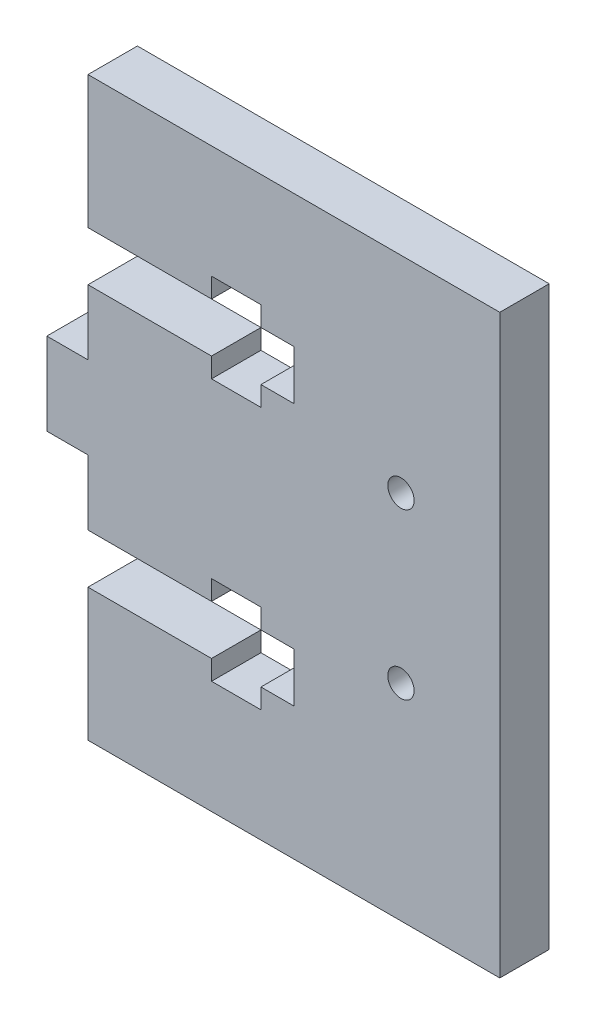
ISO-10303-21;
HEADER;
FILE_DESCRIPTION(('STEP AP214'),'2;1');
FILE_NAME('part.step','',(''),(''),'','','');
FILE_SCHEMA(('AUTOMOTIVE_DESIGN { 1 0 10303 214 1 1 1 1 }'));
ENDSEC;
DATA;
#1=APPLICATION_CONTEXT('core data for automotive mechanical design processes');
#2=APPLICATION_PROTOCOL_DEFINITION('international standard','automotive_design',2000,#1);
#3=PRODUCT_CONTEXT('',#1,'mechanical');
#4=PRODUCT('Part','Part','',(#3));
#5=PRODUCT_RELATED_PRODUCT_CATEGORY('part','',(#4));
#6=PRODUCT_DEFINITION_FORMATION('','',#4);
#7=PRODUCT_DEFINITION_CONTEXT('part definition',#1,'design');
#8=PRODUCT_DEFINITION('design','',#6,#7);
#9=PRODUCT_DEFINITION_SHAPE('','',#8);
#10=(LENGTH_UNIT() NAMED_UNIT(*) SI_UNIT(.MILLI.,.METRE.));
#11=(NAMED_UNIT(*) PLANE_ANGLE_UNIT() SI_UNIT($,.RADIAN.));
#12=(NAMED_UNIT(*) SI_UNIT($,.STERADIAN.) SOLID_ANGLE_UNIT());
#13=UNCERTAINTY_MEASURE_WITH_UNIT(LENGTH_MEASURE(1.E-05),#10,'distance_accuracy_value','');
#14=(GEOMETRIC_REPRESENTATION_CONTEXT(3) GLOBAL_UNCERTAINTY_ASSIGNED_CONTEXT((#13)) GLOBAL_UNIT_ASSIGNED_CONTEXT((#10,
#11,#12)) REPRESENTATION_CONTEXT('',''));
#15=CARTESIAN_POINT('',(0.,0.,0.));
#16=DIRECTION('',(0.,0.,1.));
#17=DIRECTION('',(1.,0.,0.));
#18=AXIS2_PLACEMENT_3D('',#15,#16,#17);
#19=CARTESIAN_POINT('',(0.,0.,6.));
#20=DIRECTION('',(0.,0.,1.));
#21=DIRECTION('',(1.,0.,0.));
#22=AXIS2_PLACEMENT_3D('',#19,#20,#21);
#23=PLANE('',#22);
#24=CARTESIAN_POINT('',(-82.9999999999995,-10.,6.));
#25=DIRECTION('',(0.,0.,1.));
#26=DIRECTION('',(1.,0.,0.));
#27=AXIS2_PLACEMENT_3D('',#24,#25,#26);
#28=CIRCLE('',#27,1.59999999999996);
#29=CARTESIAN_POINT('',(-81.3999999999996,-10.,6.));
#30=VERTEX_POINT('',#29);
#31=EDGE_CURVE('E278',#30,#30,#28,.T.);
#32=ORIENTED_EDGE('',*,*,#31,.F.);
#33=EDGE_LOOP('',(#32));
#34=FACE_BOUND('',#33,.T.);
#35=DIRECTION('',(0.,-1.,0.));
#36=VECTOR('',#35,1.);
#37=CARTESIAN_POINT('',(-121.,18.9,6.));
#38=LINE('',#37,#36);
#39=CARTESIAN_POINT('',(-121.,35.,6.));
#40=VERTEX_POINT('',#39);
#41=CARTESIAN_POINT('',(-121.,18.9,6.));
#42=VERTEX_POINT('',#41);
#43=EDGE_CURVE('E337',#40,#42,#38,.T.);
#44=ORIENTED_EDGE('',*,*,#43,.T.);
#45=DIRECTION('',(1.,0.,0.));
#46=VECTOR('',#45,1.);
#47=CARTESIAN_POINT('',(-106.,18.9,6.));
#48=LINE('',#47,#46);
#49=CARTESIAN_POINT('',(-106.,18.9,6.));
#50=VERTEX_POINT('',#49);
#51=EDGE_CURVE('E165',#42,#50,#48,.T.);
#52=ORIENTED_EDGE('',*,*,#51,.T.);
#53=DIRECTION('',(0.,1.,0.));
#54=VECTOR('',#53,1.);
#55=CARTESIAN_POINT('',(-106.,21.3,6.));
#56=LINE('',#55,#54);
#57=CARTESIAN_POINT('',(-106.,21.3,6.));
#58=VERTEX_POINT('',#57);
#59=EDGE_CURVE('E424',#50,#58,#56,.T.);
#60=ORIENTED_EDGE('',*,*,#59,.T.);
#61=DIRECTION('',(1.,0.,0.));
#62=VECTOR('',#61,1.);
#63=CARTESIAN_POINT('',(-100.,21.3,6.));
#64=LINE('',#63,#62);
#65=CARTESIAN_POINT('',(-100.,21.3,6.));
#66=VERTEX_POINT('',#65);
#67=EDGE_CURVE('E443',#58,#66,#64,.T.);
#68=ORIENTED_EDGE('',*,*,#67,.T.);
#69=DIRECTION('',(0.,-1.,0.));
#70=VECTOR('',#69,1.);
#71=CARTESIAN_POINT('',(-100.,18.9,6.));
#72=LINE('',#71,#70);
#73=CARTESIAN_POINT('',(-100.,18.9,6.));
#74=VERTEX_POINT('',#73);
#75=EDGE_CURVE('E440',#66,#74,#72,.T.);
#76=ORIENTED_EDGE('',*,*,#75,.T.);
#77=DIRECTION('',(1.,0.,0.));
#78=VECTOR('',#77,1.);
#79=CARTESIAN_POINT('',(-96.0000000000001,18.9,6.));
#80=LINE('',#79,#78);
#81=CARTESIAN_POINT('',(-96.0000000000001,18.9,6.));
#82=VERTEX_POINT('',#81);
#83=EDGE_CURVE('E442',#74,#82,#80,.T.);
#84=ORIENTED_EDGE('',*,*,#83,.T.);
#85=DIRECTION('',(0.,-1.,0.));
#86=VECTOR('',#85,1.);
#87=CARTESIAN_POINT('',(-96.0000000000001,12.9,6.));
#88=LINE('',#87,#86);
#89=CARTESIAN_POINT('',(-96.0000000000001,12.9,6.));
#90=VERTEX_POINT('',#89);
#91=EDGE_CURVE('E445',#82,#90,#88,.T.);
#92=ORIENTED_EDGE('',*,*,#91,.T.);
#93=DIRECTION('',(-1.,0.,0.));
#94=VECTOR('',#93,1.);
#95=CARTESIAN_POINT('',(-100.,12.9,6.));
#96=LINE('',#95,#94);
#97=CARTESIAN_POINT('',(-100.,12.9,6.));
#98=VERTEX_POINT('',#97);
#99=EDGE_CURVE('E451',#90,#98,#96,.T.);
#100=ORIENTED_EDGE('',*,*,#99,.T.);
#101=DIRECTION('',(0.,-1.,0.));
#102=VECTOR('',#101,1.);
#103=CARTESIAN_POINT('',(-100.,10.5,6.));
#104=LINE('',#103,#102);
#105=CARTESIAN_POINT('',(-100.,10.5,6.));
#106=VERTEX_POINT('',#105);
#107=EDGE_CURVE('E453',#98,#106,#104,.T.);
#108=ORIENTED_EDGE('',*,*,#107,.T.);
#109=DIRECTION('',(-1.,0.,0.));
#110=VECTOR('',#109,1.);
#111=CARTESIAN_POINT('',(-106.,10.5,6.));
#112=LINE('',#111,#110);
#113=CARTESIAN_POINT('',(-106.,10.5,6.));
#114=VERTEX_POINT('',#113);
#115=EDGE_CURVE('E455',#106,#114,#112,.T.);
#116=ORIENTED_EDGE('',*,*,#115,.T.);
#117=DIRECTION('',(0.,1.,0.));
#118=VECTOR('',#117,1.);
#119=CARTESIAN_POINT('',(-106.,12.9,6.));
#120=LINE('',#119,#118);
#121=CARTESIAN_POINT('',(-106.,12.9,6.));
#122=VERTEX_POINT('',#121);
#123=EDGE_CURVE('E457',#114,#122,#120,.T.);
#124=ORIENTED_EDGE('',*,*,#123,.T.);
#125=DIRECTION('',(-1.,0.,0.));
#126=VECTOR('',#125,1.);
#127=CARTESIAN_POINT('',(-121.,12.9,6.));
#128=LINE('',#127,#126);
#129=CARTESIAN_POINT('',(-121.,12.9,6.));
#130=VERTEX_POINT('',#129);
#131=EDGE_CURVE('E459',#122,#130,#128,.T.);
#132=ORIENTED_EDGE('',*,*,#131,.T.);
#133=DIRECTION('',(0.,-1.,0.));
#134=VECTOR('',#133,1.);
#135=CARTESIAN_POINT('',(-121.,5.,6.));
#136=LINE('',#135,#134);
#137=CARTESIAN_POINT('',(-121.,5.,6.));
#138=VERTEX_POINT('',#137);
#139=EDGE_CURVE('E461',#130,#138,#136,.T.);
#140=ORIENTED_EDGE('',*,*,#139,.T.);
#141=DIRECTION('',(-1.,0.,0.));
#142=VECTOR('',#141,1.);
#143=CARTESIAN_POINT('',(-121.,5.,6.));
#144=LINE('',#143,#142);
#145=CARTESIAN_POINT('',(-126.,5.,6.));
#146=VERTEX_POINT('',#145);
#147=EDGE_CURVE('E463',#138,#146,#144,.T.);
#148=ORIENTED_EDGE('',*,*,#147,.T.);
#149=DIRECTION('',(0.,-1.,0.));
#150=VECTOR('',#149,1.);
#151=CARTESIAN_POINT('',(-126.,5.,6.));
#152=LINE('',#151,#150);
#153=CARTESIAN_POINT('',(-126.,-5.,6.));
#154=VERTEX_POINT('',#153);
#155=EDGE_CURVE('E465',#146,#154,#152,.T.);
#156=ORIENTED_EDGE('',*,*,#155,.T.);
#157=DIRECTION('',(1.,0.,0.));
#158=VECTOR('',#157,1.);
#159=CARTESIAN_POINT('',(-121.,-5.,6.));
#160=LINE('',#159,#158);
#161=CARTESIAN_POINT('',(-121.,-5.,6.));
#162=VERTEX_POINT('',#161);
#163=EDGE_CURVE('E467',#154,#162,#160,.T.);
#164=ORIENTED_EDGE('',*,*,#163,.T.);
#165=DIRECTION('',(0.,-1.,0.));
#166=VECTOR('',#165,1.);
#167=CARTESIAN_POINT('',(-121.,-12.9,6.));
#168=LINE('',#167,#166);
#169=CARTESIAN_POINT('',(-121.,-12.9,6.));
#170=VERTEX_POINT('',#169);
#171=EDGE_CURVE('E469',#162,#170,#168,.T.);
#172=ORIENTED_EDGE('',*,*,#171,.T.);
#173=DIRECTION('',(1.,0.,0.));
#174=VECTOR('',#173,1.);
#175=CARTESIAN_POINT('',(-106.,-12.9,6.));
#176=LINE('',#175,#174);
#177=CARTESIAN_POINT('',(-106.,-12.9,6.));
#178=VERTEX_POINT('',#177);
#179=EDGE_CURVE('E471',#170,#178,#176,.T.);
#180=ORIENTED_EDGE('',*,*,#179,.T.);
#181=DIRECTION('',(0.,1.,0.));
#182=VECTOR('',#181,1.);
#183=CARTESIAN_POINT('',(-106.,-10.5,6.));
#184=LINE('',#183,#182);
#185=CARTESIAN_POINT('',(-106.,-10.5,6.));
#186=VERTEX_POINT('',#185);
#187=EDGE_CURVE('E473',#178,#186,#184,.T.);
#188=ORIENTED_EDGE('',*,*,#187,.T.);
#189=DIRECTION('',(1.,0.,0.));
#190=VECTOR('',#189,1.);
#191=CARTESIAN_POINT('',(-100.,-10.5,6.));
#192=LINE('',#191,#190);
#193=CARTESIAN_POINT('',(-100.,-10.5,6.));
#194=VERTEX_POINT('',#193);
#195=EDGE_CURVE('E475',#186,#194,#192,.T.);
#196=ORIENTED_EDGE('',*,*,#195,.T.);
#197=DIRECTION('',(0.,-1.,0.));
#198=VECTOR('',#197,1.);
#199=CARTESIAN_POINT('',(-100.,-12.9,6.));
#200=LINE('',#199,#198);
#201=CARTESIAN_POINT('',(-100.,-12.9,6.));
#202=VERTEX_POINT('',#201);
#203=EDGE_CURVE('E477',#194,#202,#200,.T.);
#204=ORIENTED_EDGE('',*,*,#203,.T.);
#205=DIRECTION('',(1.,0.,0.));
#206=VECTOR('',#205,1.);
#207=CARTESIAN_POINT('',(-96.0000000000001,-12.9,6.));
#208=LINE('',#207,#206);
#209=CARTESIAN_POINT('',(-96.0000000000001,-12.9,6.));
#210=VERTEX_POINT('',#209);
#211=EDGE_CURVE('E479',#202,#210,#208,.T.);
#212=ORIENTED_EDGE('',*,*,#211,.T.);
#213=DIRECTION('',(0.,-1.,0.));
#214=VECTOR('',#213,1.);
#215=CARTESIAN_POINT('',(-96.0000000000001,-18.9,6.));
#216=LINE('',#215,#214);
#217=CARTESIAN_POINT('',(-96.0000000000001,-18.9,6.));
#218=VERTEX_POINT('',#217);
#219=EDGE_CURVE('E481',#210,#218,#216,.T.);
#220=ORIENTED_EDGE('',*,*,#219,.T.);
#221=DIRECTION('',(-1.,0.,0.));
#222=VECTOR('',#221,1.);
#223=CARTESIAN_POINT('',(-100.,-18.9,6.));
#224=LINE('',#223,#222);
#225=CARTESIAN_POINT('',(-100.,-18.9,6.));
#226=VERTEX_POINT('',#225);
#227=EDGE_CURVE('E483',#218,#226,#224,.T.);
#228=ORIENTED_EDGE('',*,*,#227,.T.);
#229=DIRECTION('',(0.,-1.,0.));
#230=VECTOR('',#229,1.);
#231=CARTESIAN_POINT('',(-100.,-21.3,6.));
#232=LINE('',#231,#230);
#233=CARTESIAN_POINT('',(-100.,-21.3,6.));
#234=VERTEX_POINT('',#233);
#235=EDGE_CURVE('E485',#226,#234,#232,.T.);
#236=ORIENTED_EDGE('',*,*,#235,.T.);
#237=DIRECTION('',(-1.,0.,0.));
#238=VECTOR('',#237,1.);
#239=CARTESIAN_POINT('',(-106.,-21.3,6.));
#240=LINE('',#239,#238);
#241=CARTESIAN_POINT('',(-106.,-21.3,6.));
#242=VERTEX_POINT('',#241);
#243=EDGE_CURVE('E487',#234,#242,#240,.T.);
#244=ORIENTED_EDGE('',*,*,#243,.T.);
#245=DIRECTION('',(0.,1.,0.));
#246=VECTOR('',#245,1.);
#247=CARTESIAN_POINT('',(-106.,-18.9,6.));
#248=LINE('',#247,#246);
#249=CARTESIAN_POINT('',(-106.,-18.9,6.));
#250=VERTEX_POINT('',#249);
#251=EDGE_CURVE('E489',#242,#250,#248,.T.);
#252=ORIENTED_EDGE('',*,*,#251,.T.);
#253=DIRECTION('',(-1.,0.,0.));
#254=VECTOR('',#253,1.);
#255=CARTESIAN_POINT('',(-121.,-18.9,6.));
#256=LINE('',#255,#254);
#257=CARTESIAN_POINT('',(-121.,-18.9,6.));
#258=VERTEX_POINT('',#257);
#259=EDGE_CURVE('E491',#250,#258,#256,.T.);
#260=ORIENTED_EDGE('',*,*,#259,.T.);
#261=DIRECTION('',(0.,-1.,0.));
#262=VECTOR('',#261,1.);
#263=CARTESIAN_POINT('',(-121.,-35.,6.));
#264=LINE('',#263,#262);
#265=CARTESIAN_POINT('',(-121.,-35.,6.));
#266=VERTEX_POINT('',#265);
#267=EDGE_CURVE('E256',#258,#266,#264,.T.);
#268=ORIENTED_EDGE('',*,*,#267,.T.);
#269=DIRECTION('',(1.,0.,0.));
#270=VECTOR('',#269,1.);
#271=CARTESIAN_POINT('',(-71.,-35.,6.));
#272=LINE('',#271,#270);
#273=CARTESIAN_POINT('',(-71.,-35.,6.));
#274=VERTEX_POINT('',#273);
#275=EDGE_CURVE('E250',#266,#274,#272,.T.);
#276=ORIENTED_EDGE('',*,*,#275,.T.);
#277=DIRECTION('',(0.,1.,0.));
#278=VECTOR('',#277,1.);
#279=CARTESIAN_POINT('',(-71.,-35.,6.));
#280=LINE('',#279,#278);
#281=CARTESIAN_POINT('',(-71.,35.,6.));
#282=VERTEX_POINT('',#281);
#283=EDGE_CURVE('E254',#274,#282,#280,.T.);
#284=ORIENTED_EDGE('',*,*,#283,.T.);
#285=DIRECTION('',(-1.,0.,0.));
#286=VECTOR('',#285,1.);
#287=CARTESIAN_POINT('',(-71.,35.,6.));
#288=LINE('',#287,#286);
#289=EDGE_CURVE('E50',#282,#40,#288,.T.);
#290=ORIENTED_EDGE('',*,*,#289,.T.);
#291=EDGE_LOOP('',(#44,#52,#60,#68,#76,#84,#92,#100,#108,#116,#124,#132,#140,#148,#156,#164,
#172,#180,#188,#196,#204,#212,#220,#228,#236,#244,#252,#260,#268,#276,#284,#290));
#292=FACE_BOUND('',#291,.T.);
#293=CARTESIAN_POINT('',(-83.,10.,6.));
#294=DIRECTION('',(0.,0.,1.));
#295=DIRECTION('',(1.,0.,0.));
#296=AXIS2_PLACEMENT_3D('',#293,#294,#295);
#297=CIRCLE('',#296,1.59999999999996);
#298=CARTESIAN_POINT('',(-81.4000000000001,10.,6.));
#299=VERTEX_POINT('',#298);
#300=EDGE_CURVE('E533',#299,#299,#297,.T.);
#301=ORIENTED_EDGE('',*,*,#300,.F.);
#302=EDGE_LOOP('',(#301));
#303=FACE_BOUND('',#302,.T.);
#304=ADVANCED_FACE('F33',(#34,#292,#303),#23,.T.);
#305=CARTESIAN_POINT('',(0.,0.,0.));
#306=DIRECTION('',(0.,0.,1.));
#307=DIRECTION('',(1.,0.,0.));
#308=AXIS2_PLACEMENT_3D('',#305,#306,#307);
#309=PLANE('',#308);
#310=DIRECTION('',(0.,-1.,0.));
#311=VECTOR('',#310,1.);
#312=CARTESIAN_POINT('',(-121.,18.9,0.));
#313=LINE('',#312,#311);
#314=CARTESIAN_POINT('',(-121.,35.,0.));
#315=VERTEX_POINT('',#314);
#316=CARTESIAN_POINT('',(-121.,18.9,0.));
#317=VERTEX_POINT('',#316);
#318=EDGE_CURVE('E274',#315,#317,#313,.T.);
#319=ORIENTED_EDGE('',*,*,#318,.F.);
#320=DIRECTION('',(-1.,0.,0.));
#321=VECTOR('',#320,1.);
#322=CARTESIAN_POINT('',(-71.,35.,0.));
#323=LINE('',#322,#321);
#324=CARTESIAN_POINT('',(-71.,35.,0.));
#325=VERTEX_POINT('',#324);
#326=EDGE_CURVE('E157',#325,#315,#323,.T.);
#327=ORIENTED_EDGE('',*,*,#326,.F.);
#328=DIRECTION('',(0.,1.,0.));
#329=VECTOR('',#328,1.);
#330=CARTESIAN_POINT('',(-71.,-35.,0.));
#331=LINE('',#330,#329);
#332=CARTESIAN_POINT('',(-71.,-35.,0.));
#333=VERTEX_POINT('',#332);
#334=EDGE_CURVE('E151',#333,#325,#331,.T.);
#335=ORIENTED_EDGE('',*,*,#334,.F.);
#336=DIRECTION('',(1.,0.,0.));
#337=VECTOR('',#336,1.);
#338=CARTESIAN_POINT('',(-71.,-35.,0.));
#339=LINE('',#338,#337);
#340=CARTESIAN_POINT('',(-121.,-35.,0.));
#341=VERTEX_POINT('',#340);
#342=EDGE_CURVE('E264',#341,#333,#339,.T.);
#343=ORIENTED_EDGE('',*,*,#342,.F.);
#344=DIRECTION('',(0.,-1.,0.));
#345=VECTOR('',#344,1.);
#346=CARTESIAN_POINT('',(-121.,-35.,0.));
#347=LINE('',#346,#345);
#348=CARTESIAN_POINT('',(-121.,-18.9,0.));
#349=VERTEX_POINT('',#348);
#350=EDGE_CURVE('E332',#349,#341,#347,.T.);
#351=ORIENTED_EDGE('',*,*,#350,.F.);
#352=DIRECTION('',(-1.,0.,0.));
#353=VECTOR('',#352,1.);
#354=CARTESIAN_POINT('',(-121.,-18.9,0.));
#355=LINE('',#354,#353);
#356=CARTESIAN_POINT('',(-106.,-18.9,0.));
#357=VERTEX_POINT('',#356);
#358=EDGE_CURVE('E330',#357,#349,#355,.T.);
#359=ORIENTED_EDGE('',*,*,#358,.F.);
#360=DIRECTION('',(0.,1.,0.));
#361=VECTOR('',#360,1.);
#362=CARTESIAN_POINT('',(-106.,-18.9,0.));
#363=LINE('',#362,#361);
#364=CARTESIAN_POINT('',(-106.,-21.3,0.));
#365=VERTEX_POINT('',#364);
#366=EDGE_CURVE('E328',#365,#357,#363,.T.);
#367=ORIENTED_EDGE('',*,*,#366,.F.);
#368=DIRECTION('',(-1.,0.,0.));
#369=VECTOR('',#368,1.);
#370=CARTESIAN_POINT('',(-106.,-21.3,0.));
#371=LINE('',#370,#369);
#372=CARTESIAN_POINT('',(-100.,-21.3,0.));
#373=VERTEX_POINT('',#372);
#374=EDGE_CURVE('E326',#373,#365,#371,.T.);
#375=ORIENTED_EDGE('',*,*,#374,.F.);
#376=DIRECTION('',(0.,-1.,0.));
#377=VECTOR('',#376,1.);
#378=CARTESIAN_POINT('',(-100.,-21.3,0.));
#379=LINE('',#378,#377);
#380=CARTESIAN_POINT('',(-100.,-18.9,0.));
#381=VERTEX_POINT('',#380);
#382=EDGE_CURVE('E324',#381,#373,#379,.T.);
#383=ORIENTED_EDGE('',*,*,#382,.F.);
#384=DIRECTION('',(-1.,0.,0.));
#385=VECTOR('',#384,1.);
#386=CARTESIAN_POINT('',(-100.,-18.9,0.));
#387=LINE('',#386,#385);
#388=CARTESIAN_POINT('',(-96.0000000000001,-18.9,0.));
#389=VERTEX_POINT('',#388);
#390=EDGE_CURVE('E322',#389,#381,#387,.T.);
#391=ORIENTED_EDGE('',*,*,#390,.F.);
#392=DIRECTION('',(0.,-1.,0.));
#393=VECTOR('',#392,1.);
#394=CARTESIAN_POINT('',(-96.0000000000001,-18.9,0.));
#395=LINE('',#394,#393);
#396=CARTESIAN_POINT('',(-96.0000000000001,-12.9,0.));
#397=VERTEX_POINT('',#396);
#398=EDGE_CURVE('E320',#397,#389,#395,.T.);
#399=ORIENTED_EDGE('',*,*,#398,.F.);
#400=DIRECTION('',(1.,0.,0.));
#401=VECTOR('',#400,1.);
#402=CARTESIAN_POINT('',(-96.0000000000001,-12.9,0.));
#403=LINE('',#402,#401);
#404=CARTESIAN_POINT('',(-100.,-12.9,0.));
#405=VERTEX_POINT('',#404);
#406=EDGE_CURVE('E318',#405,#397,#403,.T.);
#407=ORIENTED_EDGE('',*,*,#406,.F.);
#408=DIRECTION('',(0.,-1.,0.));
#409=VECTOR('',#408,1.);
#410=CARTESIAN_POINT('',(-100.,-12.9,0.));
#411=LINE('',#410,#409);
#412=CARTESIAN_POINT('',(-100.,-10.5,0.));
#413=VERTEX_POINT('',#412);
#414=EDGE_CURVE('E316',#413,#405,#411,.T.);
#415=ORIENTED_EDGE('',*,*,#414,.F.);
#416=DIRECTION('',(1.,0.,0.));
#417=VECTOR('',#416,1.);
#418=CARTESIAN_POINT('',(-100.,-10.5,0.));
#419=LINE('',#418,#417);
#420=CARTESIAN_POINT('',(-106.,-10.5,0.));
#421=VERTEX_POINT('',#420);
#422=EDGE_CURVE('E314',#421,#413,#419,.T.);
#423=ORIENTED_EDGE('',*,*,#422,.F.);
#424=DIRECTION('',(0.,1.,0.));
#425=VECTOR('',#424,1.);
#426=CARTESIAN_POINT('',(-106.,-10.5,0.));
#427=LINE('',#426,#425);
#428=CARTESIAN_POINT('',(-106.,-12.9,0.));
#429=VERTEX_POINT('',#428);
#430=EDGE_CURVE('E312',#429,#421,#427,.T.);
#431=ORIENTED_EDGE('',*,*,#430,.F.);
#432=DIRECTION('',(1.,0.,0.));
#433=VECTOR('',#432,1.);
#434=CARTESIAN_POINT('',(-106.,-12.9,0.));
#435=LINE('',#434,#433);
#436=CARTESIAN_POINT('',(-121.,-12.9,0.));
#437=VERTEX_POINT('',#436);
#438=EDGE_CURVE('E310',#437,#429,#435,.T.);
#439=ORIENTED_EDGE('',*,*,#438,.F.);
#440=DIRECTION('',(0.,-1.,0.));
#441=VECTOR('',#440,1.);
#442=CARTESIAN_POINT('',(-121.,-12.9,0.));
#443=LINE('',#442,#441);
#444=CARTESIAN_POINT('',(-121.,-5.,0.));
#445=VERTEX_POINT('',#444);
#446=EDGE_CURVE('E308',#445,#437,#443,.T.);
#447=ORIENTED_EDGE('',*,*,#446,.F.);
#448=DIRECTION('',(1.,0.,0.));
#449=VECTOR('',#448,1.);
#450=CARTESIAN_POINT('',(-121.,-5.,0.));
#451=LINE('',#450,#449);
#452=CARTESIAN_POINT('',(-126.,-5.,0.));
#453=VERTEX_POINT('',#452);
#454=EDGE_CURVE('E306',#453,#445,#451,.T.);
#455=ORIENTED_EDGE('',*,*,#454,.F.);
#456=DIRECTION('',(0.,-1.,0.));
#457=VECTOR('',#456,1.);
#458=CARTESIAN_POINT('',(-126.,5.,0.));
#459=LINE('',#458,#457);
#460=CARTESIAN_POINT('',(-126.,5.,0.));
#461=VERTEX_POINT('',#460);
#462=EDGE_CURVE('E304',#461,#453,#459,.T.);
#463=ORIENTED_EDGE('',*,*,#462,.F.);
#464=DIRECTION('',(-1.,0.,0.));
#465=VECTOR('',#464,1.);
#466=CARTESIAN_POINT('',(-121.,5.,0.));
#467=LINE('',#466,#465);
#468=CARTESIAN_POINT('',(-121.,5.,0.));
#469=VERTEX_POINT('',#468);
#470=EDGE_CURVE('E302',#469,#461,#467,.T.);
#471=ORIENTED_EDGE('',*,*,#470,.F.);
#472=DIRECTION('',(0.,-1.,0.));
#473=VECTOR('',#472,1.);
#474=CARTESIAN_POINT('',(-121.,5.,0.));
#475=LINE('',#474,#473);
#476=CARTESIAN_POINT('',(-121.,12.9,0.));
#477=VERTEX_POINT('',#476);
#478=EDGE_CURVE('E300',#477,#469,#475,.T.);
#479=ORIENTED_EDGE('',*,*,#478,.F.);
#480=DIRECTION('',(-1.,0.,0.));
#481=VECTOR('',#480,1.);
#482=CARTESIAN_POINT('',(-121.,12.9,0.));
#483=LINE('',#482,#481);
#484=CARTESIAN_POINT('',(-106.,12.9,0.));
#485=VERTEX_POINT('',#484);
#486=EDGE_CURVE('E298',#485,#477,#483,.T.);
#487=ORIENTED_EDGE('',*,*,#486,.F.);
#488=DIRECTION('',(0.,1.,0.));
#489=VECTOR('',#488,1.);
#490=CARTESIAN_POINT('',(-106.,12.9,0.));
#491=LINE('',#490,#489);
#492=CARTESIAN_POINT('',(-106.,10.5,0.));
#493=VERTEX_POINT('',#492);
#494=EDGE_CURVE('E296',#493,#485,#491,.T.);
#495=ORIENTED_EDGE('',*,*,#494,.F.);
#496=DIRECTION('',(-1.,0.,0.));
#497=VECTOR('',#496,1.);
#498=CARTESIAN_POINT('',(-106.,10.5,0.));
#499=LINE('',#498,#497);
#500=CARTESIAN_POINT('',(-100.,10.5,0.));
#501=VERTEX_POINT('',#500);
#502=EDGE_CURVE('E294',#501,#493,#499,.T.);
#503=ORIENTED_EDGE('',*,*,#502,.F.);
#504=DIRECTION('',(0.,-1.,0.));
#505=VECTOR('',#504,1.);
#506=CARTESIAN_POINT('',(-100.,10.5,0.));
#507=LINE('',#506,#505);
#508=CARTESIAN_POINT('',(-100.,12.9,0.));
#509=VERTEX_POINT('',#508);
#510=EDGE_CURVE('E292',#509,#501,#507,.T.);
#511=ORIENTED_EDGE('',*,*,#510,.F.);
#512=DIRECTION('',(-1.,0.,0.));
#513=VECTOR('',#512,1.);
#514=CARTESIAN_POINT('',(-100.,12.9,0.));
#515=LINE('',#514,#513);
#516=CARTESIAN_POINT('',(-96.0000000000001,12.9,0.));
#517=VERTEX_POINT('',#516);
#518=EDGE_CURVE('E290',#517,#509,#515,.T.);
#519=ORIENTED_EDGE('',*,*,#518,.F.);
#520=DIRECTION('',(0.,-1.,0.));
#521=VECTOR('',#520,1.);
#522=CARTESIAN_POINT('',(-96.0000000000001,12.9,0.));
#523=LINE('',#522,#521);
#524=CARTESIAN_POINT('',(-96.0000000000001,18.9,0.));
#525=VERTEX_POINT('',#524);
#526=EDGE_CURVE('E288',#525,#517,#523,.T.);
#527=ORIENTED_EDGE('',*,*,#526,.F.);
#528=DIRECTION('',(1.,0.,0.));
#529=VECTOR('',#528,1.);
#530=CARTESIAN_POINT('',(-96.0000000000001,18.9,0.));
#531=LINE('',#530,#529);
#532=CARTESIAN_POINT('',(-100.,18.9,0.));
#533=VERTEX_POINT('',#532);
#534=EDGE_CURVE('E286',#533,#525,#531,.T.);
#535=ORIENTED_EDGE('',*,*,#534,.F.);
#536=DIRECTION('',(0.,-1.,0.));
#537=VECTOR('',#536,1.);
#538=CARTESIAN_POINT('',(-100.,18.9,0.));
#539=LINE('',#538,#537);
#540=CARTESIAN_POINT('',(-100.,21.3,0.));
#541=VERTEX_POINT('',#540);
#542=EDGE_CURVE('E284',#541,#533,#539,.T.);
#543=ORIENTED_EDGE('',*,*,#542,.F.);
#544=DIRECTION('',(1.,0.,0.));
#545=VECTOR('',#544,1.);
#546=CARTESIAN_POINT('',(-100.,21.3,0.));
#547=LINE('',#546,#545);
#548=CARTESIAN_POINT('',(-106.,21.3,0.));
#549=VERTEX_POINT('',#548);
#550=EDGE_CURVE('E282',#549,#541,#547,.T.);
#551=ORIENTED_EDGE('',*,*,#550,.F.);
#552=DIRECTION('',(0.,1.,0.));
#553=VECTOR('',#552,1.);
#554=CARTESIAN_POINT('',(-106.,21.3,0.));
#555=LINE('',#554,#553);
#556=CARTESIAN_POINT('',(-106.,18.9,0.));
#557=VERTEX_POINT('',#556);
#558=EDGE_CURVE('E280',#557,#549,#555,.T.);
#559=ORIENTED_EDGE('',*,*,#558,.F.);
#560=DIRECTION('',(1.,0.,0.));
#561=VECTOR('',#560,1.);
#562=CARTESIAN_POINT('',(-106.,18.9,0.));
#563=LINE('',#562,#561);
#564=EDGE_CURVE('E277',#317,#557,#563,.T.);
#565=ORIENTED_EDGE('',*,*,#564,.F.);
#566=EDGE_LOOP('',(#319,#327,#335,#343,#351,#359,#367,#375,#383,#391,#399,#407,#415,#423,#431,
#439,#447,#455,#463,#471,#479,#487,#495,#503,#511,#519,#527,#535,#543,#551,#559,#565));
#567=FACE_BOUND('',#566,.T.);
#568=CARTESIAN_POINT('',(-82.9999999999995,-10.,0.));
#569=DIRECTION('',(0.,0.,1.));
#570=DIRECTION('',(1.,0.,0.));
#571=AXIS2_PLACEMENT_3D('',#568,#569,#570);
#572=CIRCLE('',#571,1.59999999999996);
#573=CARTESIAN_POINT('',(-81.3999999999996,-10.,0.));
#574=VERTEX_POINT('',#573);
#575=EDGE_CURVE('E539',#574,#574,#572,.T.);
#576=ORIENTED_EDGE('',*,*,#575,.T.);
#577=EDGE_LOOP('',(#576));
#578=FACE_BOUND('',#577,.T.);
#579=CARTESIAN_POINT('',(-83.,10.,0.));
#580=DIRECTION('',(0.,0.,1.));
#581=DIRECTION('',(1.,0.,0.));
#582=AXIS2_PLACEMENT_3D('',#579,#580,#581);
#583=CIRCLE('',#582,1.59999999999996);
#584=CARTESIAN_POINT('',(-81.4000000000001,10.,0.));
#585=VERTEX_POINT('',#584);
#586=EDGE_CURVE('E536',#585,#585,#583,.T.);
#587=ORIENTED_EDGE('',*,*,#586,.T.);
#588=EDGE_LOOP('',(#587));
#589=FACE_BOUND('',#588,.T.);
#590=ADVANCED_FACE('F428',(#567,#578,#589),#309,.F.);
#591=CARTESIAN_POINT('',(-121.,18.9,6.));
#592=DIRECTION('',(1.,0.,0.));
#593=DIRECTION('',(0.,1.,0.));
#594=AXIS2_PLACEMENT_3D('',#591,#592,#593);
#595=PLANE('',#594);
#596=ORIENTED_EDGE('',*,*,#318,.T.);
#597=DIRECTION('',(0.,0.,-1.));
#598=VECTOR('',#597,1.);
#599=CARTESIAN_POINT('',(-121.,18.9,6.));
#600=LINE('',#599,#598);
#601=EDGE_CURVE('E11',#42,#317,#600,.T.);
#602=ORIENTED_EDGE('',*,*,#601,.F.);
#603=ORIENTED_EDGE('',*,*,#43,.F.);
#604=DIRECTION('',(0.,0.,-1.));
#605=VECTOR('',#604,1.);
#606=CARTESIAN_POINT('',(-121.,35.,6.));
#607=LINE('',#606,#605);
#608=EDGE_CURVE('E270',#40,#315,#607,.T.);
#609=ORIENTED_EDGE('',*,*,#608,.T.);
#610=EDGE_LOOP('',(#596,#602,#603,#609));
#611=FACE_BOUND('',#610,.T.);
#612=ADVANCED_FACE('F35',(#611),#595,.F.);
#613=CARTESIAN_POINT('',(-106.,18.9,6.));
#614=DIRECTION('',(0.,1.,0.));
#615=DIRECTION('',(0.,0.,1.));
#616=AXIS2_PLACEMENT_3D('',#613,#614,#615);
#617=PLANE('',#616);
#618=ORIENTED_EDGE('',*,*,#564,.T.);
#619=DIRECTION('',(0.,0.,-1.));
#620=VECTOR('',#619,1.);
#621=CARTESIAN_POINT('',(-106.,18.9,6.));
#622=LINE('',#621,#620);
#623=EDGE_CURVE('E42',#50,#557,#622,.T.);
#624=ORIENTED_EDGE('',*,*,#623,.F.);
#625=ORIENTED_EDGE('',*,*,#51,.F.);
#626=ORIENTED_EDGE('',*,*,#601,.T.);
#627=EDGE_LOOP('',(#618,#624,#625,#626));
#628=FACE_BOUND('',#627,.T.);
#629=ADVANCED_FACE('F832',(#628),#617,.F.);
#630=CARTESIAN_POINT('',(-106.,21.3,6.));
#631=DIRECTION('',(-1.,0.,0.));
#632=DIRECTION('',(0.,0.,1.));
#633=AXIS2_PLACEMENT_3D('',#630,#631,#632);
#634=PLANE('',#633);
#635=ORIENTED_EDGE('',*,*,#558,.T.);
#636=DIRECTION('',(0.,0.,-1.));
#637=VECTOR('',#636,1.);
#638=CARTESIAN_POINT('',(-106.,21.3,6.));
#639=LINE('',#638,#637);
#640=EDGE_CURVE('E416',#58,#549,#639,.T.);
#641=ORIENTED_EDGE('',*,*,#640,.F.);
#642=ORIENTED_EDGE('',*,*,#59,.F.);
#643=ORIENTED_EDGE('',*,*,#623,.T.);
#644=EDGE_LOOP('',(#635,#641,#642,#643));
#645=FACE_BOUND('',#644,.T.);
#646=ADVANCED_FACE('F422',(#645),#634,.F.);
#647=CARTESIAN_POINT('',(-100.,21.3,6.));
#648=DIRECTION('',(0.,1.,0.));
#649=DIRECTION('',(0.,0.,1.));
#650=AXIS2_PLACEMENT_3D('',#647,#648,#649);
#651=PLANE('',#650);
#652=ORIENTED_EDGE('',*,*,#550,.T.);
#653=DIRECTION('',(0.,0.,-1.));
#654=VECTOR('',#653,1.);
#655=CARTESIAN_POINT('',(-100.,21.3,6.));
#656=LINE('',#655,#654);
#657=EDGE_CURVE('E413',#66,#541,#656,.T.);
#658=ORIENTED_EDGE('',*,*,#657,.F.);
#659=ORIENTED_EDGE('',*,*,#67,.F.);
#660=ORIENTED_EDGE('',*,*,#640,.T.);
#661=EDGE_LOOP('',(#652,#658,#659,#660));
#662=FACE_BOUND('',#661,.T.);
#663=ADVANCED_FACE('F434',(#662),#651,.F.);
#664=CARTESIAN_POINT('',(-100.,18.9,6.));
#665=DIRECTION('',(1.,0.,0.));
#666=DIRECTION('',(0.,0.,-1.));
#667=AXIS2_PLACEMENT_3D('',#664,#665,#666);
#668=PLANE('',#667);
#669=ORIENTED_EDGE('',*,*,#542,.T.);
#670=DIRECTION('',(0.,0.,-1.));
#671=VECTOR('',#670,1.);
#672=CARTESIAN_POINT('',(-100.,18.9,6.));
#673=LINE('',#672,#671);
#674=EDGE_CURVE('E410',#74,#533,#673,.T.);
#675=ORIENTED_EDGE('',*,*,#674,.F.);
#676=ORIENTED_EDGE('',*,*,#75,.F.);
#677=ORIENTED_EDGE('',*,*,#657,.T.);
#678=EDGE_LOOP('',(#669,#675,#676,#677));
#679=FACE_BOUND('',#678,.T.);
#680=ADVANCED_FACE('F438',(#679),#668,.F.);
#681=CARTESIAN_POINT('',(-96.0000000000001,18.9,6.));
#682=DIRECTION('',(0.,1.,0.));
#683=DIRECTION('',(0.,0.,1.));
#684=AXIS2_PLACEMENT_3D('',#681,#682,#683);
#685=PLANE('',#684);
#686=ORIENTED_EDGE('',*,*,#534,.T.);
#687=DIRECTION('',(0.,0.,-1.));
#688=VECTOR('',#687,1.);
#689=CARTESIAN_POINT('',(-96.0000000000001,18.9,6.));
#690=LINE('',#689,#688);
#691=EDGE_CURVE('E407',#82,#525,#690,.T.);
#692=ORIENTED_EDGE('',*,*,#691,.F.);
#693=ORIENTED_EDGE('',*,*,#83,.F.);
#694=ORIENTED_EDGE('',*,*,#674,.T.);
#695=EDGE_LOOP('',(#686,#692,#693,#694));
#696=FACE_BOUND('',#695,.T.);
#697=ADVANCED_FACE('F797',(#696),#685,.F.);
#698=CARTESIAN_POINT('',(-96.0000000000001,12.9,6.));
#699=DIRECTION('',(1.,0.,0.));
#700=DIRECTION('',(0.,0.,-1.));
#701=AXIS2_PLACEMENT_3D('',#698,#699,#700);
#702=PLANE('',#701);
#703=ORIENTED_EDGE('',*,*,#526,.T.);
#704=DIRECTION('',(0.,0.,-1.));
#705=VECTOR('',#704,1.);
#706=CARTESIAN_POINT('',(-96.0000000000001,12.9,6.));
#707=LINE('',#706,#705);
#708=EDGE_CURVE('E404',#90,#517,#707,.T.);
#709=ORIENTED_EDGE('',*,*,#708,.F.);
#710=ORIENTED_EDGE('',*,*,#91,.F.);
#711=ORIENTED_EDGE('',*,*,#691,.T.);
#712=EDGE_LOOP('',(#703,#709,#710,#711));
#713=FACE_BOUND('',#712,.T.);
#714=ADVANCED_FACE('F787',(#713),#702,.F.);
#715=CARTESIAN_POINT('',(-100.,12.9,6.));
#716=DIRECTION('',(0.,-1.,0.));
#717=DIRECTION('',(0.,0.,-1.));
#718=AXIS2_PLACEMENT_3D('',#715,#716,#717);
#719=PLANE('',#718);
#720=ORIENTED_EDGE('',*,*,#518,.T.);
#721=DIRECTION('',(0.,0.,-1.));
#722=VECTOR('',#721,1.);
#723=CARTESIAN_POINT('',(-100.,12.9,6.));
#724=LINE('',#723,#722);
#725=EDGE_CURVE('E401',#98,#509,#724,.T.);
#726=ORIENTED_EDGE('',*,*,#725,.F.);
#727=ORIENTED_EDGE('',*,*,#99,.F.);
#728=ORIENTED_EDGE('',*,*,#708,.T.);
#729=EDGE_LOOP('',(#720,#726,#727,#728));
#730=FACE_BOUND('',#729,.T.);
#731=ADVANCED_FACE('F777',(#730),#719,.F.);
#732=CARTESIAN_POINT('',(-100.,10.5,6.));
#733=DIRECTION('',(1.,0.,0.));
#734=DIRECTION('',(0.,0.,-1.));
#735=AXIS2_PLACEMENT_3D('',#732,#733,#734);
#736=PLANE('',#735);
#737=ORIENTED_EDGE('',*,*,#510,.T.);
#738=DIRECTION('',(0.,0.,-1.));
#739=VECTOR('',#738,1.);
#740=CARTESIAN_POINT('',(-100.,10.5,6.));
#741=LINE('',#740,#739);
#742=EDGE_CURVE('E398',#106,#501,#741,.T.);
#743=ORIENTED_EDGE('',*,*,#742,.F.);
#744=ORIENTED_EDGE('',*,*,#107,.F.);
#745=ORIENTED_EDGE('',*,*,#725,.T.);
#746=EDGE_LOOP('',(#737,#743,#744,#745));
#747=FACE_BOUND('',#746,.T.);
#748=ADVANCED_FACE('F767',(#747),#736,.F.);
#749=CARTESIAN_POINT('',(-106.,10.5,6.));
#750=DIRECTION('',(0.,-1.,0.));
#751=DIRECTION('',(0.,0.,-1.));
#752=AXIS2_PLACEMENT_3D('',#749,#750,#751);
#753=PLANE('',#752);
#754=ORIENTED_EDGE('',*,*,#502,.T.);
#755=DIRECTION('',(0.,0.,-1.));
#756=VECTOR('',#755,1.);
#757=CARTESIAN_POINT('',(-106.,10.5,6.));
#758=LINE('',#757,#756);
#759=EDGE_CURVE('E395',#114,#493,#758,.T.);
#760=ORIENTED_EDGE('',*,*,#759,.F.);
#761=ORIENTED_EDGE('',*,*,#115,.F.);
#762=ORIENTED_EDGE('',*,*,#742,.T.);
#763=EDGE_LOOP('',(#754,#760,#761,#762));
#764=FACE_BOUND('',#763,.T.);
#765=ADVANCED_FACE('F757',(#764),#753,.F.);
#766=CARTESIAN_POINT('',(-106.,12.9,6.));
#767=DIRECTION('',(-1.,0.,0.));
#768=DIRECTION('',(0.,0.,1.));
#769=AXIS2_PLACEMENT_3D('',#766,#767,#768);
#770=PLANE('',#769);
#771=ORIENTED_EDGE('',*,*,#494,.T.);
#772=DIRECTION('',(0.,0.,-1.));
#773=VECTOR('',#772,1.);
#774=CARTESIAN_POINT('',(-106.,12.9,6.));
#775=LINE('',#774,#773);
#776=EDGE_CURVE('E392',#122,#485,#775,.T.);
#777=ORIENTED_EDGE('',*,*,#776,.F.);
#778=ORIENTED_EDGE('',*,*,#123,.F.);
#779=ORIENTED_EDGE('',*,*,#759,.T.);
#780=EDGE_LOOP('',(#771,#777,#778,#779));
#781=FACE_BOUND('',#780,.T.);
#782=ADVANCED_FACE('F747',(#781),#770,.F.);
#783=CARTESIAN_POINT('',(-121.,12.9,6.));
#784=DIRECTION('',(0.,-1.,0.));
#785=DIRECTION('',(0.,0.,-1.));
#786=AXIS2_PLACEMENT_3D('',#783,#784,#785);
#787=PLANE('',#786);
#788=ORIENTED_EDGE('',*,*,#486,.T.);
#789=DIRECTION('',(0.,0.,-1.));
#790=VECTOR('',#789,1.);
#791=CARTESIAN_POINT('',(-121.,12.9,6.));
#792=LINE('',#791,#790);
#793=EDGE_CURVE('E389',#130,#477,#792,.T.);
#794=ORIENTED_EDGE('',*,*,#793,.F.);
#795=ORIENTED_EDGE('',*,*,#131,.F.);
#796=ORIENTED_EDGE('',*,*,#776,.T.);
#797=EDGE_LOOP('',(#788,#794,#795,#796));
#798=FACE_BOUND('',#797,.T.);
#799=ADVANCED_FACE('F737',(#798),#787,.F.);
#800=CARTESIAN_POINT('',(-121.,5.,6.));
#801=DIRECTION('',(1.,0.,0.));
#802=DIRECTION('',(0.,0.,-1.));
#803=AXIS2_PLACEMENT_3D('',#800,#801,#802);
#804=PLANE('',#803);
#805=ORIENTED_EDGE('',*,*,#478,.T.);
#806=DIRECTION('',(0.,0.,-1.));
#807=VECTOR('',#806,1.);
#808=CARTESIAN_POINT('',(-121.,5.,6.));
#809=LINE('',#808,#807);
#810=EDGE_CURVE('E386',#138,#469,#809,.T.);
#811=ORIENTED_EDGE('',*,*,#810,.F.);
#812=ORIENTED_EDGE('',*,*,#139,.F.);
#813=ORIENTED_EDGE('',*,*,#793,.T.);
#814=EDGE_LOOP('',(#805,#811,#812,#813));
#815=FACE_BOUND('',#814,.T.);
#816=ADVANCED_FACE('F727',(#815),#804,.F.);
#817=CARTESIAN_POINT('',(-121.,5.,6.));
#818=DIRECTION('',(0.,-1.,0.));
#819=DIRECTION('',(0.,0.,-1.));
#820=AXIS2_PLACEMENT_3D('',#817,#818,#819);
#821=PLANE('',#820);
#822=ORIENTED_EDGE('',*,*,#470,.T.);
#823=DIRECTION('',(0.,0.,-1.));
#824=VECTOR('',#823,1.);
#825=CARTESIAN_POINT('',(-126.,5.,6.));
#826=LINE('',#825,#824);
#827=EDGE_CURVE('E383',#146,#461,#826,.T.);
#828=ORIENTED_EDGE('',*,*,#827,.F.);
#829=ORIENTED_EDGE('',*,*,#147,.F.);
#830=ORIENTED_EDGE('',*,*,#810,.T.);
#831=EDGE_LOOP('',(#822,#828,#829,#830));
#832=FACE_BOUND('',#831,.T.);
#833=ADVANCED_FACE('F717',(#832),#821,.F.);
#834=CARTESIAN_POINT('',(-126.,5.,6.));
#835=DIRECTION('',(1.,0.,0.));
#836=DIRECTION('',(0.,0.,-1.));
#837=AXIS2_PLACEMENT_3D('',#834,#835,#836);
#838=PLANE('',#837);
#839=ORIENTED_EDGE('',*,*,#462,.T.);
#840=DIRECTION('',(0.,0.,-1.));
#841=VECTOR('',#840,1.);
#842=CARTESIAN_POINT('',(-126.,-5.,6.));
#843=LINE('',#842,#841);
#844=EDGE_CURVE('E380',#154,#453,#843,.T.);
#845=ORIENTED_EDGE('',*,*,#844,.F.);
#846=ORIENTED_EDGE('',*,*,#155,.F.);
#847=ORIENTED_EDGE('',*,*,#827,.T.);
#848=EDGE_LOOP('',(#839,#845,#846,#847));
#849=FACE_BOUND('',#848,.T.);
#850=ADVANCED_FACE('F707',(#849),#838,.F.);
#851=CARTESIAN_POINT('',(-121.,-5.,6.));
#852=DIRECTION('',(0.,1.,0.));
#853=DIRECTION('',(0.,0.,1.));
#854=AXIS2_PLACEMENT_3D('',#851,#852,#853);
#855=PLANE('',#854);
#856=ORIENTED_EDGE('',*,*,#454,.T.);
#857=DIRECTION('',(0.,0.,-1.));
#858=VECTOR('',#857,1.);
#859=CARTESIAN_POINT('',(-121.,-5.,6.));
#860=LINE('',#859,#858);
#861=EDGE_CURVE('E377',#162,#445,#860,.T.);
#862=ORIENTED_EDGE('',*,*,#861,.F.);
#863=ORIENTED_EDGE('',*,*,#163,.F.);
#864=ORIENTED_EDGE('',*,*,#844,.T.);
#865=EDGE_LOOP('',(#856,#862,#863,#864));
#866=FACE_BOUND('',#865,.T.);
#867=ADVANCED_FACE('F697',(#866),#855,.F.);
#868=CARTESIAN_POINT('',(-121.,-12.9,6.));
#869=DIRECTION('',(1.,0.,0.));
#870=DIRECTION('',(0.,1.,0.));
#871=AXIS2_PLACEMENT_3D('',#868,#869,#870);
#872=PLANE('',#871);
#873=ORIENTED_EDGE('',*,*,#446,.T.);
#874=DIRECTION('',(0.,0.,-1.));
#875=VECTOR('',#874,1.);
#876=CARTESIAN_POINT('',(-121.,-12.9,6.));
#877=LINE('',#876,#875);
#878=EDGE_CURVE('E374',#170,#437,#877,.T.);
#879=ORIENTED_EDGE('',*,*,#878,.F.);
#880=ORIENTED_EDGE('',*,*,#171,.F.);
#881=ORIENTED_EDGE('',*,*,#861,.T.);
#882=EDGE_LOOP('',(#873,#879,#880,#881));
#883=FACE_BOUND('',#882,.T.);
#884=ADVANCED_FACE('F687',(#883),#872,.F.);
#885=CARTESIAN_POINT('',(-106.,-12.9,6.));
#886=DIRECTION('',(0.,1.,0.));
#887=DIRECTION('',(0.,0.,1.));
#888=AXIS2_PLACEMENT_3D('',#885,#886,#887);
#889=PLANE('',#888);
#890=ORIENTED_EDGE('',*,*,#438,.T.);
#891=DIRECTION('',(0.,0.,-1.));
#892=VECTOR('',#891,1.);
#893=CARTESIAN_POINT('',(-106.,-12.9,6.));
#894=LINE('',#893,#892);
#895=EDGE_CURVE('E371',#178,#429,#894,.T.);
#896=ORIENTED_EDGE('',*,*,#895,.F.);
#897=ORIENTED_EDGE('',*,*,#179,.F.);
#898=ORIENTED_EDGE('',*,*,#878,.T.);
#899=EDGE_LOOP('',(#890,#896,#897,#898));
#900=FACE_BOUND('',#899,.T.);
#901=ADVANCED_FACE('F677',(#900),#889,.F.);
#902=CARTESIAN_POINT('',(-106.,-10.5,6.));
#903=DIRECTION('',(-1.,0.,0.));
#904=DIRECTION('',(0.,-1.,0.));
#905=AXIS2_PLACEMENT_3D('',#902,#903,#904);
#906=PLANE('',#905);
#907=ORIENTED_EDGE('',*,*,#430,.T.);
#908=DIRECTION('',(0.,0.,-1.));
#909=VECTOR('',#908,1.);
#910=CARTESIAN_POINT('',(-106.,-10.5,6.));
#911=LINE('',#910,#909);
#912=EDGE_CURVE('E368',#186,#421,#911,.T.);
#913=ORIENTED_EDGE('',*,*,#912,.F.);
#914=ORIENTED_EDGE('',*,*,#187,.F.);
#915=ORIENTED_EDGE('',*,*,#895,.T.);
#916=EDGE_LOOP('',(#907,#913,#914,#915));
#917=FACE_BOUND('',#916,.T.);
#918=ADVANCED_FACE('F667',(#917),#906,.F.);
#919=CARTESIAN_POINT('',(-100.,-10.5,6.));
#920=DIRECTION('',(0.,1.,0.));
#921=DIRECTION('',(0.,0.,1.));
#922=AXIS2_PLACEMENT_3D('',#919,#920,#921);
#923=PLANE('',#922);
#924=ORIENTED_EDGE('',*,*,#422,.T.);
#925=DIRECTION('',(0.,0.,-1.));
#926=VECTOR('',#925,1.);
#927=CARTESIAN_POINT('',(-100.,-10.5,6.));
#928=LINE('',#927,#926);
#929=EDGE_CURVE('E365',#194,#413,#928,.T.);
#930=ORIENTED_EDGE('',*,*,#929,.F.);
#931=ORIENTED_EDGE('',*,*,#195,.F.);
#932=ORIENTED_EDGE('',*,*,#912,.T.);
#933=EDGE_LOOP('',(#924,#930,#931,#932));
#934=FACE_BOUND('',#933,.T.);
#935=ADVANCED_FACE('F657',(#934),#923,.F.);
#936=CARTESIAN_POINT('',(-100.,-12.9,6.));
#937=DIRECTION('',(1.,0.,0.));
#938=DIRECTION('',(0.,0.,-1.));
#939=AXIS2_PLACEMENT_3D('',#936,#937,#938);
#940=PLANE('',#939);
#941=ORIENTED_EDGE('',*,*,#414,.T.);
#942=DIRECTION('',(0.,0.,-1.));
#943=VECTOR('',#942,1.);
#944=CARTESIAN_POINT('',(-100.,-12.9,6.));
#945=LINE('',#944,#943);
#946=EDGE_CURVE('E362',#202,#405,#945,.T.);
#947=ORIENTED_EDGE('',*,*,#946,.F.);
#948=ORIENTED_EDGE('',*,*,#203,.F.);
#949=ORIENTED_EDGE('',*,*,#929,.T.);
#950=EDGE_LOOP('',(#941,#947,#948,#949));
#951=FACE_BOUND('',#950,.T.);
#952=ADVANCED_FACE('F647',(#951),#940,.F.);
#953=CARTESIAN_POINT('',(-96.0000000000001,-12.9,6.));
#954=DIRECTION('',(0.,1.,0.));
#955=DIRECTION('',(0.,0.,1.));
#956=AXIS2_PLACEMENT_3D('',#953,#954,#955);
#957=PLANE('',#956);
#958=ORIENTED_EDGE('',*,*,#406,.T.);
#959=DIRECTION('',(0.,0.,-1.));
#960=VECTOR('',#959,1.);
#961=CARTESIAN_POINT('',(-96.0000000000001,-12.9,6.));
#962=LINE('',#961,#960);
#963=EDGE_CURVE('E359',#210,#397,#962,.T.);
#964=ORIENTED_EDGE('',*,*,#963,.F.);
#965=ORIENTED_EDGE('',*,*,#211,.F.);
#966=ORIENTED_EDGE('',*,*,#946,.T.);
#967=EDGE_LOOP('',(#958,#964,#965,#966));
#968=FACE_BOUND('',#967,.T.);
#969=ADVANCED_FACE('F637',(#968),#957,.F.);
#970=CARTESIAN_POINT('',(-96.0000000000001,-18.9,6.));
#971=DIRECTION('',(1.,0.,0.));
#972=DIRECTION('',(0.,0.,-1.));
#973=AXIS2_PLACEMENT_3D('',#970,#971,#972);
#974=PLANE('',#973);
#975=ORIENTED_EDGE('',*,*,#398,.T.);
#976=DIRECTION('',(0.,0.,-1.));
#977=VECTOR('',#976,1.);
#978=CARTESIAN_POINT('',(-96.0000000000001,-18.9,6.));
#979=LINE('',#978,#977);
#980=EDGE_CURVE('E356',#218,#389,#979,.T.);
#981=ORIENTED_EDGE('',*,*,#980,.F.);
#982=ORIENTED_EDGE('',*,*,#219,.F.);
#983=ORIENTED_EDGE('',*,*,#963,.T.);
#984=EDGE_LOOP('',(#975,#981,#982,#983));
#985=FACE_BOUND('',#984,.T.);
#986=ADVANCED_FACE('F627',(#985),#974,.F.);
#987=CARTESIAN_POINT('',(-100.,-18.9,6.));
#988=DIRECTION('',(0.,-1.,0.));
#989=DIRECTION('',(0.,0.,-1.));
#990=AXIS2_PLACEMENT_3D('',#987,#988,#989);
#991=PLANE('',#990);
#992=ORIENTED_EDGE('',*,*,#390,.T.);
#993=DIRECTION('',(0.,0.,-1.));
#994=VECTOR('',#993,1.);
#995=CARTESIAN_POINT('',(-100.,-18.9,6.));
#996=LINE('',#995,#994);
#997=EDGE_CURVE('E353',#226,#381,#996,.T.);
#998=ORIENTED_EDGE('',*,*,#997,.F.);
#999=ORIENTED_EDGE('',*,*,#227,.F.);
#1000=ORIENTED_EDGE('',*,*,#980,.T.);
#1001=EDGE_LOOP('',(#992,#998,#999,#1000));
#1002=FACE_BOUND('',#1001,.T.);
#1003=ADVANCED_FACE('F617',(#1002),#991,.F.);
#1004=CARTESIAN_POINT('',(-100.,-21.3,6.));
#1005=DIRECTION('',(1.,0.,0.));
#1006=DIRECTION('',(0.,0.,-1.));
#1007=AXIS2_PLACEMENT_3D('',#1004,#1005,#1006);
#1008=PLANE('',#1007);
#1009=ORIENTED_EDGE('',*,*,#382,.T.);
#1010=DIRECTION('',(0.,0.,-1.));
#1011=VECTOR('',#1010,1.);
#1012=CARTESIAN_POINT('',(-100.,-21.3,6.));
#1013=LINE('',#1012,#1011);
#1014=EDGE_CURVE('E350',#234,#373,#1013,.T.);
#1015=ORIENTED_EDGE('',*,*,#1014,.F.);
#1016=ORIENTED_EDGE('',*,*,#235,.F.);
#1017=ORIENTED_EDGE('',*,*,#997,.T.);
#1018=EDGE_LOOP('',(#1009,#1015,#1016,#1017));
#1019=FACE_BOUND('',#1018,.T.);
#1020=ADVANCED_FACE('F607',(#1019),#1008,.F.);
#1021=CARTESIAN_POINT('',(-106.,-21.3,6.));
#1022=DIRECTION('',(0.,-1.,0.));
#1023=DIRECTION('',(0.,0.,-1.));
#1024=AXIS2_PLACEMENT_3D('',#1021,#1022,#1023);
#1025=PLANE('',#1024);
#1026=ORIENTED_EDGE('',*,*,#374,.T.);
#1027=DIRECTION('',(0.,0.,-1.));
#1028=VECTOR('',#1027,1.);
#1029=CARTESIAN_POINT('',(-106.,-21.3,6.));
#1030=LINE('',#1029,#1028);
#1031=EDGE_CURVE('E347',#242,#365,#1030,.T.);
#1032=ORIENTED_EDGE('',*,*,#1031,.F.);
#1033=ORIENTED_EDGE('',*,*,#243,.F.);
#1034=ORIENTED_EDGE('',*,*,#1014,.T.);
#1035=EDGE_LOOP('',(#1026,#1032,#1033,#1034));
#1036=FACE_BOUND('',#1035,.T.);
#1037=ADVANCED_FACE('F597',(#1036),#1025,.F.);
#1038=CARTESIAN_POINT('',(-106.,-18.9,6.));
#1039=DIRECTION('',(-1.,0.,0.));
#1040=DIRECTION('',(0.,0.,1.));
#1041=AXIS2_PLACEMENT_3D('',#1038,#1039,#1040);
#1042=PLANE('',#1041);
#1043=ORIENTED_EDGE('',*,*,#366,.T.);
#1044=DIRECTION('',(0.,0.,-1.));
#1045=VECTOR('',#1044,1.);
#1046=CARTESIAN_POINT('',(-106.,-18.9,6.));
#1047=LINE('',#1046,#1045);
#1048=EDGE_CURVE('E344',#250,#357,#1047,.T.);
#1049=ORIENTED_EDGE('',*,*,#1048,.F.);
#1050=ORIENTED_EDGE('',*,*,#251,.F.);
#1051=ORIENTED_EDGE('',*,*,#1031,.T.);
#1052=EDGE_LOOP('',(#1043,#1049,#1050,#1051));
#1053=FACE_BOUND('',#1052,.T.);
#1054=ADVANCED_FACE('F588',(#1053),#1042,.F.);
#1055=CARTESIAN_POINT('',(-121.,-18.9,6.));
#1056=DIRECTION('',(0.,-1.,0.));
#1057=DIRECTION('',(0.,0.,-1.));
#1058=AXIS2_PLACEMENT_3D('',#1055,#1056,#1057);
#1059=PLANE('',#1058);
#1060=ORIENTED_EDGE('',*,*,#358,.T.);
#1061=DIRECTION('',(0.,0.,-1.));
#1062=VECTOR('',#1061,1.);
#1063=CARTESIAN_POINT('',(-121.,-18.9,6.));
#1064=LINE('',#1063,#1062);
#1065=EDGE_CURVE('E341',#258,#349,#1064,.T.);
#1066=ORIENTED_EDGE('',*,*,#1065,.F.);
#1067=ORIENTED_EDGE('',*,*,#259,.F.);
#1068=ORIENTED_EDGE('',*,*,#1048,.T.);
#1069=EDGE_LOOP('',(#1060,#1066,#1067,#1068));
#1070=FACE_BOUND('',#1069,.T.);
#1071=ADVANCED_FACE('F497',(#1070),#1059,.F.);
#1072=CARTESIAN_POINT('',(-121.,-35.,6.));
#1073=DIRECTION('',(1.,0.,0.));
#1074=DIRECTION('',(0.,0.,-1.));
#1075=AXIS2_PLACEMENT_3D('',#1072,#1073,#1074);
#1076=PLANE('',#1075);
#1077=ORIENTED_EDGE('',*,*,#350,.T.);
#1078=DIRECTION('',(0.,0.,-1.));
#1079=VECTOR('',#1078,1.);
#1080=CARTESIAN_POINT('',(-121.,-35.,6.));
#1081=LINE('',#1080,#1079);
#1082=EDGE_CURVE('E265',#266,#341,#1081,.T.);
#1083=ORIENTED_EDGE('',*,*,#1082,.F.);
#1084=ORIENTED_EDGE('',*,*,#267,.F.);
#1085=ORIENTED_EDGE('',*,*,#1065,.T.);
#1086=EDGE_LOOP('',(#1077,#1083,#1084,#1085));
#1087=FACE_BOUND('',#1086,.T.);
#1088=ADVANCED_FACE('F501',(#1087),#1076,.F.);
#1089=CARTESIAN_POINT('',(-71.,-35.,6.));
#1090=DIRECTION('',(0.,1.,0.));
#1091=DIRECTION('',(0.,0.,1.));
#1092=AXIS2_PLACEMENT_3D('',#1089,#1090,#1091);
#1093=PLANE('',#1092);
#1094=ORIENTED_EDGE('',*,*,#342,.T.);
#1095=DIRECTION('',(0.,0.,-1.));
#1096=VECTOR('',#1095,1.);
#1097=CARTESIAN_POINT('',(-71.,-35.,6.));
#1098=LINE('',#1097,#1096);
#1099=EDGE_CURVE('E261',#274,#333,#1098,.T.);
#1100=ORIENTED_EDGE('',*,*,#1099,.F.);
#1101=ORIENTED_EDGE('',*,*,#275,.F.);
#1102=ORIENTED_EDGE('',*,*,#1082,.T.);
#1103=EDGE_LOOP('',(#1094,#1100,#1101,#1102));
#1104=FACE_BOUND('',#1103,.T.);
#1105=ADVANCED_FACE('F262',(#1104),#1093,.F.);
#1106=CARTESIAN_POINT('',(-71.,-35.,6.));
#1107=DIRECTION('',(-1.,0.,0.));
#1108=DIRECTION('',(0.,0.,1.));
#1109=AXIS2_PLACEMENT_3D('',#1106,#1107,#1108);
#1110=PLANE('',#1109);
#1111=ORIENTED_EDGE('',*,*,#334,.T.);
#1112=DIRECTION('',(0.,0.,-1.));
#1113=VECTOR('',#1112,1.);
#1114=CARTESIAN_POINT('',(-71.,35.,6.));
#1115=LINE('',#1114,#1113);
#1116=EDGE_CURVE('E266',#282,#325,#1115,.T.);
#1117=ORIENTED_EDGE('',*,*,#1116,.F.);
#1118=ORIENTED_EDGE('',*,*,#283,.F.);
#1119=ORIENTED_EDGE('',*,*,#1099,.T.);
#1120=EDGE_LOOP('',(#1111,#1117,#1118,#1119));
#1121=FACE_BOUND('',#1120,.T.);
#1122=ADVANCED_FACE('F268',(#1121),#1110,.F.);
#1123=CARTESIAN_POINT('',(-71.,35.,6.));
#1124=DIRECTION('',(0.,-1.,0.));
#1125=DIRECTION('',(0.,0.,-1.));
#1126=AXIS2_PLACEMENT_3D('',#1123,#1124,#1125);
#1127=PLANE('',#1126);
#1128=ORIENTED_EDGE('',*,*,#326,.T.);
#1129=ORIENTED_EDGE('',*,*,#608,.F.);
#1130=ORIENTED_EDGE('',*,*,#289,.F.);
#1131=ORIENTED_EDGE('',*,*,#1116,.T.);
#1132=EDGE_LOOP('',(#1128,#1129,#1130,#1131));
#1133=FACE_BOUND('',#1132,.T.);
#1134=ADVANCED_FACE('F505',(#1133),#1127,.F.);
#1135=CARTESIAN_POINT('',(-82.9999999999995,-10.,6.));
#1136=DIRECTION('',(0.,0.,-1.));
#1137=DIRECTION('',(-1.,0.,0.));
#1138=AXIS2_PLACEMENT_3D('',#1135,#1136,#1137);
#1139=CYLINDRICAL_SURFACE('',#1138,1.59999999999996);
#1140=ORIENTED_EDGE('',*,*,#31,.T.);
#1141=EDGE_LOOP('',(#1140));
#1142=FACE_BOUND('',#1141,.T.);
#1143=ORIENTED_EDGE('',*,*,#575,.F.);
#1144=EDGE_LOOP('',(#1143));
#1145=FACE_BOUND('',#1144,.T.);
#1146=ADVANCED_FACE('F507',(#1142,#1145),#1139,.F.);
#1147=CARTESIAN_POINT('',(-83.,10.,6.));
#1148=DIRECTION('',(0.,0.,-1.));
#1149=DIRECTION('',(-1.,0.,0.));
#1150=AXIS2_PLACEMENT_3D('',#1147,#1148,#1149);
#1151=CYLINDRICAL_SURFACE('',#1150,1.59999999999996);
#1152=ORIENTED_EDGE('',*,*,#300,.T.);
#1153=EDGE_LOOP('',(#1152));
#1154=FACE_BOUND('',#1153,.T.);
#1155=ORIENTED_EDGE('',*,*,#586,.F.);
#1156=EDGE_LOOP('',(#1155));
#1157=FACE_BOUND('',#1156,.T.);
#1158=ADVANCED_FACE('F513',(#1154,#1157),#1151,.F.);
#1159=CLOSED_SHELL('',(#304,#590,#612,#629,#646,#663,#680,#697,#714,#731,#748,#765,#782,#799,
#816,#833,#850,#867,#884,#901,#918,#935,#952,#969,#986,#1003,#1020,#1037,#1054,#1071,#1088,
#1105,#1122,#1134,#1146,#1158));
#1160=MANIFOLD_SOLID_BREP('B2',#1159);
#1161=ADVANCED_BREP_SHAPE_REPRESENTATION('',(#18,#1160),#14);
#1162=SHAPE_DEFINITION_REPRESENTATION(#9,#1161);
ENDSEC;
END-ISO-10303-21;
